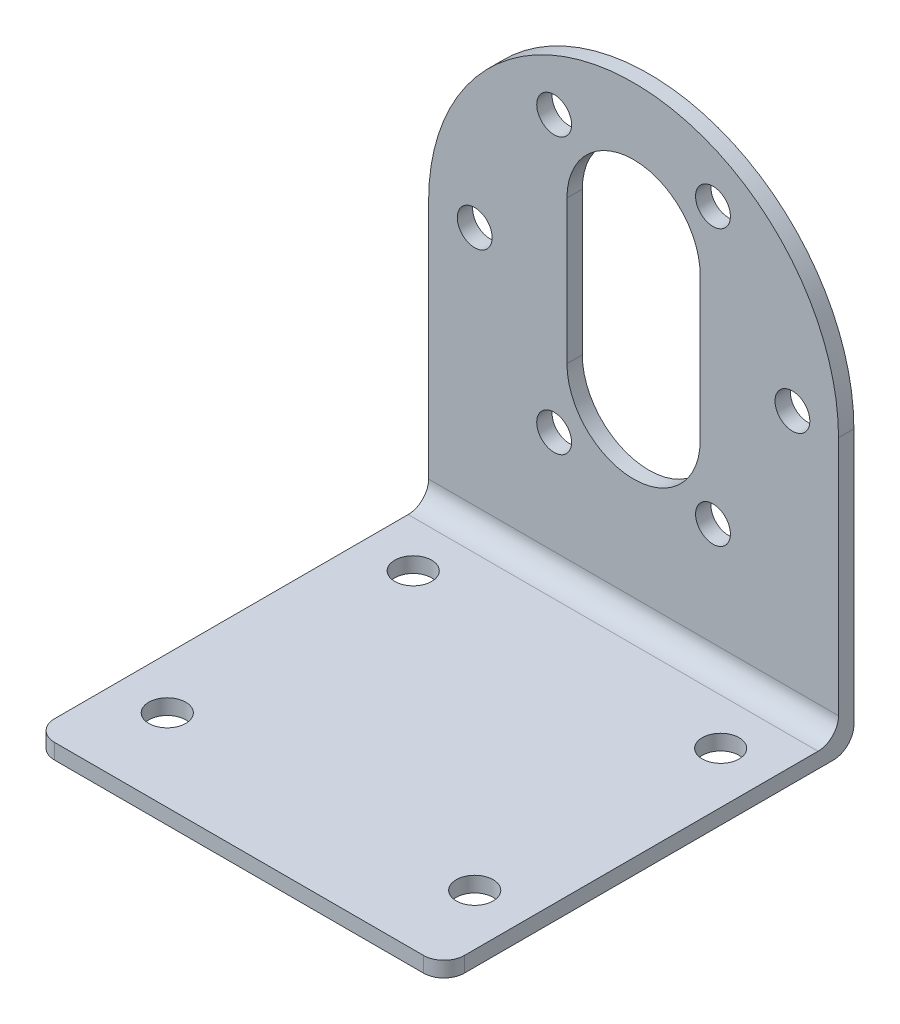
ISO-10303-21;
HEADER;
FILE_DESCRIPTION(('STEP AP214'),'2;1');
FILE_NAME('part.step','',(''),(''),'','','');
FILE_SCHEMA(('AUTOMOTIVE_DESIGN { 1 0 10303 214 1 1 1 1 }'));
ENDSEC;
DATA;
#1=APPLICATION_CONTEXT('core data for automotive mechanical design processes');
#2=APPLICATION_PROTOCOL_DEFINITION('international standard','automotive_design',2000,#1);
#3=PRODUCT_CONTEXT('',#1,'mechanical');
#4=PRODUCT('Part','Part','',(#3));
#5=PRODUCT_RELATED_PRODUCT_CATEGORY('part','',(#4));
#6=PRODUCT_DEFINITION_FORMATION('','',#4);
#7=PRODUCT_DEFINITION_CONTEXT('part definition',#1,'design');
#8=PRODUCT_DEFINITION('design','',#6,#7);
#9=PRODUCT_DEFINITION_SHAPE('','',#8);
#10=(LENGTH_UNIT() NAMED_UNIT(*) SI_UNIT(.MILLI.,.METRE.));
#11=(NAMED_UNIT(*) PLANE_ANGLE_UNIT() SI_UNIT($,.RADIAN.));
#12=(NAMED_UNIT(*) SI_UNIT($,.STERADIAN.) SOLID_ANGLE_UNIT());
#13=UNCERTAINTY_MEASURE_WITH_UNIT(LENGTH_MEASURE(1.E-05),#10,'distance_accuracy_value','');
#14=(GEOMETRIC_REPRESENTATION_CONTEXT(3) GLOBAL_UNCERTAINTY_ASSIGNED_CONTEXT((#13)) GLOBAL_UNIT_ASSIGNED_CONTEXT((#10,
#11,#12)) REPRESENTATION_CONTEXT('',''));
#15=CARTESIAN_POINT('',(0.,0.,0.));
#16=DIRECTION('',(0.,0.,1.));
#17=DIRECTION('',(1.,0.,0.));
#18=AXIS2_PLACEMENT_3D('',#15,#16,#17);
#19=CARTESIAN_POINT('',(0.,1.5,-40.));
#20=DIRECTION('',(0.,0.,1.));
#21=DIRECTION('',(1.,0.,0.));
#22=AXIS2_PLACEMENT_3D('',#19,#20,#21);
#23=PLANE('',#22);
#24=CARTESIAN_POINT('',(35.5,27.,-40.));
#25=DIRECTION('',(0.,0.,-1.));
#26=DIRECTION('',(-1.,0.,0.));
#27=AXIS2_PLACEMENT_3D('',#24,#25,#26);
#28=CIRCLE('',#27,1.7);
#29=CARTESIAN_POINT('',(33.8,27.,-40.));
#30=VERTEX_POINT('',#29);
#31=EDGE_CURVE('E403',#30,#30,#28,.T.);
#32=ORIENTED_EDGE('',*,*,#31,.F.);
#33=EDGE_LOOP('',(#32));
#34=FACE_BOUND('',#33,.T.);
#35=CARTESIAN_POINT('',(27.7500000000002,13.5766062413413,-40.));
#36=DIRECTION('',(0.,0.,-1.));
#37=DIRECTION('',(-1.,0.,0.));
#38=AXIS2_PLACEMENT_3D('',#35,#36,#37);
#39=CIRCLE('',#38,1.7);
#40=CARTESIAN_POINT('',(26.0500000000002,13.5766062413413,-40.));
#41=VERTEX_POINT('',#40);
#42=EDGE_CURVE('E411',#41,#41,#39,.T.);
#43=ORIENTED_EDGE('',*,*,#42,.F.);
#44=EDGE_LOOP('',(#43));
#45=FACE_BOUND('',#44,.T.);
#46=CARTESIAN_POINT('',(12.2500000000001,13.5766062413411,-40.));
#47=DIRECTION('',(0.,0.,-1.));
#48=DIRECTION('',(-1.,0.,0.));
#49=AXIS2_PLACEMENT_3D('',#46,#47,#48);
#50=CIRCLE('',#49,1.7);
#51=CARTESIAN_POINT('',(10.5500000000001,13.5766062413411,-40.));
#52=VERTEX_POINT('',#51);
#53=EDGE_CURVE('E430',#52,#52,#50,.T.);
#54=ORIENTED_EDGE('',*,*,#53,.F.);
#55=EDGE_LOOP('',(#54));
#56=FACE_BOUND('',#55,.T.);
#57=CARTESIAN_POINT('',(4.5,26.9999999999999,-40.));
#58=DIRECTION('',(0.,0.,-1.));
#59=DIRECTION('',(-1.,0.,0.));
#60=AXIS2_PLACEMENT_3D('',#57,#58,#59);
#61=CIRCLE('',#60,1.7);
#62=CARTESIAN_POINT('',(2.8,26.9999999999999,-40.));
#63=VERTEX_POINT('',#62);
#64=EDGE_CURVE('E424',#63,#63,#61,.T.);
#65=ORIENTED_EDGE('',*,*,#64,.F.);
#66=EDGE_LOOP('',(#65));
#67=FACE_BOUND('',#66,.T.);
#68=CARTESIAN_POINT('',(12.2499999999999,40.4233937586588,-40.));
#69=DIRECTION('',(0.,0.,-1.));
#70=DIRECTION('',(-1.,0.,0.));
#71=AXIS2_PLACEMENT_3D('',#68,#69,#70);
#72=CIRCLE('',#71,1.7);
#73=CARTESIAN_POINT('',(10.5499999999999,40.4233937586588,-40.));
#74=VERTEX_POINT('',#73);
#75=EDGE_CURVE('E418',#74,#74,#72,.T.);
#76=ORIENTED_EDGE('',*,*,#75,.F.);
#77=EDGE_LOOP('',(#76));
#78=FACE_BOUND('',#77,.T.);
#79=CARTESIAN_POINT('',(27.75,40.4233937586588,-40.));
#80=DIRECTION('',(0.,0.,-1.));
#81=DIRECTION('',(-1.,0.,0.));
#82=AXIS2_PLACEMENT_3D('',#79,#80,#81);
#83=CIRCLE('',#82,1.7);
#84=CARTESIAN_POINT('',(26.05,40.4233937586588,-40.));
#85=VERTEX_POINT('',#84);
#86=EDGE_CURVE('E406',#85,#85,#83,.T.);
#87=ORIENTED_EDGE('',*,*,#86,.F.);
#88=EDGE_LOOP('',(#87));
#89=FACE_BOUND('',#88,.T.);
#90=CARTESIAN_POINT('',(20.,20.,-40.));
#91=DIRECTION('',(0.,0.,-1.));
#92=DIRECTION('',(-1.,0.,0.));
#93=AXIS2_PLACEMENT_3D('',#90,#91,#92);
#94=CIRCLE('',#93,6.5);
#95=CARTESIAN_POINT('',(26.5,20.,-40.));
#96=VERTEX_POINT('',#95);
#97=CARTESIAN_POINT('',(13.5,20.,-40.));
#98=VERTEX_POINT('',#97);
#99=EDGE_CURVE('E447',#96,#98,#94,.T.);
#100=ORIENTED_EDGE('',*,*,#99,.F.);
#101=DIRECTION('',(0.,-1.,0.));
#102=VECTOR('',#101,1.);
#103=CARTESIAN_POINT('',(26.5,0.,-40.));
#104=LINE('',#103,#102);
#105=CARTESIAN_POINT('',(26.5,34.,-40.));
#106=VERTEX_POINT('',#105);
#107=EDGE_CURVE('E445',#106,#96,#104,.T.);
#108=ORIENTED_EDGE('',*,*,#107,.F.);
#109=CARTESIAN_POINT('',(20.,34.,-40.));
#110=DIRECTION('',(0.,0.,-1.));
#111=DIRECTION('',(-1.,0.,0.));
#112=AXIS2_PLACEMENT_3D('',#109,#110,#111);
#113=CIRCLE('',#112,6.5);
#114=CARTESIAN_POINT('',(13.5,34.,-40.));
#115=VERTEX_POINT('',#114);
#116=EDGE_CURVE('E453',#115,#106,#113,.T.);
#117=ORIENTED_EDGE('',*,*,#116,.F.);
#118=DIRECTION('',(0.,-1.,0.));
#119=VECTOR('',#118,1.);
#120=CARTESIAN_POINT('',(13.5,0.,-40.));
#121=LINE('',#120,#119);
#122=EDGE_CURVE('E450',#115,#98,#121,.T.);
#123=ORIENTED_EDGE('',*,*,#122,.T.);
#124=EDGE_LOOP('',(#100,#108,#117,#123));
#125=FACE_BOUND('',#124,.T.);
#126=DIRECTION('',(0.,-1.,0.));
#127=VECTOR('',#126,1.);
#128=CARTESIAN_POINT('',(40.,1.5,-40.));
#129=LINE('',#128,#127);
#130=CARTESIAN_POINT('',(40.,27.,-40.));
#131=VERTEX_POINT('',#130);
#132=CARTESIAN_POINT('',(40.,2.,-40.));
#133=VERTEX_POINT('',#132);
#134=EDGE_CURVE('E235',#131,#133,#129,.T.);
#135=ORIENTED_EDGE('',*,*,#134,.T.);
#136=DIRECTION('',(-1.,0.,0.));
#137=VECTOR('',#136,1.);
#138=CARTESIAN_POINT('',(0.,2.,-40.));
#139=LINE('',#138,#137);
#140=CARTESIAN_POINT('',(0.,2.,-40.));
#141=VERTEX_POINT('',#140);
#142=EDGE_CURVE('E246',#133,#141,#139,.T.);
#143=ORIENTED_EDGE('',*,*,#142,.T.);
#144=DIRECTION('',(0.,-1.,0.));
#145=VECTOR('',#144,1.);
#146=CARTESIAN_POINT('',(0.,1.5,-40.));
#147=LINE('',#146,#145);
#148=CARTESIAN_POINT('',(0.,27.,-40.));
#149=VERTEX_POINT('',#148);
#150=EDGE_CURVE('E229',#149,#141,#147,.T.);
#151=ORIENTED_EDGE('',*,*,#150,.F.);
#152=CARTESIAN_POINT('',(20.,27.,-40.));
#153=DIRECTION('',(0.,0.,-1.));
#154=DIRECTION('',(-1.,0.,0.));
#155=AXIS2_PLACEMENT_3D('',#152,#153,#154);
#156=CIRCLE('',#155,20.);
#157=EDGE_CURVE('E195',#149,#131,#156,.T.);
#158=ORIENTED_EDGE('',*,*,#157,.T.);
#159=EDGE_LOOP('',(#135,#143,#151,#158));
#160=FACE_BOUND('',#159,.T.);
#161=ADVANCED_FACE('F82',(#34,#45,#56,#67,#78,#89,#125,#160),#23,.F.);
#162=CARTESIAN_POINT('',(0.,47.,-38.5));
#163=DIRECTION('',(0.,0.,-1.));
#164=DIRECTION('',(-1.,0.,0.));
#165=AXIS2_PLACEMENT_3D('',#162,#163,#164);
#166=PLANE('',#165);
#167=CARTESIAN_POINT('',(35.5,27.,-38.5));
#168=DIRECTION('',(0.,0.,-1.));
#169=DIRECTION('',(-1.,0.,0.));
#170=AXIS2_PLACEMENT_3D('',#167,#168,#169);
#171=CIRCLE('',#170,1.7);
#172=CARTESIAN_POINT('',(33.8,27.,-38.5));
#173=VERTEX_POINT('',#172);
#174=EDGE_CURVE('E206',#173,#173,#171,.F.);
#175=ORIENTED_EDGE('',*,*,#174,.F.);
#176=EDGE_LOOP('',(#175));
#177=FACE_BOUND('',#176,.T.);
#178=CARTESIAN_POINT('',(27.7500000000002,13.5766062413413,-38.5));
#179=DIRECTION('',(0.,0.,-1.));
#180=DIRECTION('',(-1.,0.,0.));
#181=AXIS2_PLACEMENT_3D('',#178,#179,#180);
#182=CIRCLE('',#181,1.7);
#183=CARTESIAN_POINT('',(26.0500000000002,13.5766062413413,-38.5));
#184=VERTEX_POINT('',#183);
#185=EDGE_CURVE('E400',#184,#184,#182,.F.);
#186=ORIENTED_EDGE('',*,*,#185,.F.);
#187=EDGE_LOOP('',(#186));
#188=FACE_BOUND('',#187,.T.);
#189=CARTESIAN_POINT('',(12.2500000000001,13.5766062413411,-38.5));
#190=DIRECTION('',(0.,0.,-1.));
#191=DIRECTION('',(-1.,0.,0.));
#192=AXIS2_PLACEMENT_3D('',#189,#190,#191);
#193=CIRCLE('',#192,1.7);
#194=CARTESIAN_POINT('',(10.5500000000001,13.5766062413411,-38.5));
#195=VERTEX_POINT('',#194);
#196=EDGE_CURVE('E414',#195,#195,#193,.F.);
#197=ORIENTED_EDGE('',*,*,#196,.F.);
#198=EDGE_LOOP('',(#197));
#199=FACE_BOUND('',#198,.T.);
#200=CARTESIAN_POINT('',(4.5,26.9999999999999,-38.5));
#201=DIRECTION('',(0.,0.,-1.));
#202=DIRECTION('',(-1.,0.,0.));
#203=AXIS2_PLACEMENT_3D('',#200,#201,#202);
#204=CIRCLE('',#203,1.7);
#205=CARTESIAN_POINT('',(2.8,26.9999999999999,-38.5));
#206=VERTEX_POINT('',#205);
#207=EDGE_CURVE('E427',#206,#206,#204,.F.);
#208=ORIENTED_EDGE('',*,*,#207,.F.);
#209=EDGE_LOOP('',(#208));
#210=FACE_BOUND('',#209,.T.);
#211=CARTESIAN_POINT('',(12.2499999999999,40.4233937586588,-38.5));
#212=DIRECTION('',(0.,0.,-1.));
#213=DIRECTION('',(-1.,0.,0.));
#214=AXIS2_PLACEMENT_3D('',#211,#212,#213);
#215=CIRCLE('',#214,1.7);
#216=CARTESIAN_POINT('',(10.5499999999999,40.4233937586588,-38.5));
#217=VERTEX_POINT('',#216);
#218=EDGE_CURVE('E421',#217,#217,#215,.F.);
#219=ORIENTED_EDGE('',*,*,#218,.F.);
#220=EDGE_LOOP('',(#219));
#221=FACE_BOUND('',#220,.T.);
#222=CARTESIAN_POINT('',(27.75,40.4233937586588,-38.5));
#223=DIRECTION('',(0.,0.,-1.));
#224=DIRECTION('',(-1.,0.,0.));
#225=AXIS2_PLACEMENT_3D('',#222,#223,#224);
#226=CIRCLE('',#225,1.7);
#227=CARTESIAN_POINT('',(26.05,40.4233937586588,-38.5));
#228=VERTEX_POINT('',#227);
#229=EDGE_CURVE('E415',#228,#228,#226,.F.);
#230=ORIENTED_EDGE('',*,*,#229,.F.);
#231=EDGE_LOOP('',(#230));
#232=FACE_BOUND('',#231,.T.);
#233=CARTESIAN_POINT('',(20.,34.,-38.5));
#234=DIRECTION('',(0.,0.,-1.));
#235=DIRECTION('',(-1.,0.,0.));
#236=AXIS2_PLACEMENT_3D('',#233,#234,#235);
#237=CIRCLE('',#236,6.5);
#238=CARTESIAN_POINT('',(26.5,34.,-38.5));
#239=VERTEX_POINT('',#238);
#240=CARTESIAN_POINT('',(13.5,34.,-38.5));
#241=VERTEX_POINT('',#240);
#242=EDGE_CURVE('E439',#239,#241,#237,.F.);
#243=ORIENTED_EDGE('',*,*,#242,.F.);
#244=DIRECTION('',(0.,1.,0.));
#245=VECTOR('',#244,1.);
#246=CARTESIAN_POINT('',(26.5,0.,-38.5));
#247=LINE('',#246,#245);
#248=CARTESIAN_POINT('',(26.5,20.,-38.5));
#249=VERTEX_POINT('',#248);
#250=EDGE_CURVE('E442',#249,#239,#247,.T.);
#251=ORIENTED_EDGE('',*,*,#250,.F.);
#252=CARTESIAN_POINT('',(20.,20.,-38.5));
#253=DIRECTION('',(0.,0.,-1.));
#254=DIRECTION('',(-1.,0.,0.));
#255=AXIS2_PLACEMENT_3D('',#252,#253,#254);
#256=CIRCLE('',#255,6.5);
#257=CARTESIAN_POINT('',(13.5,20.,-38.5));
#258=VERTEX_POINT('',#257);
#259=EDGE_CURVE('E196',#258,#249,#256,.F.);
#260=ORIENTED_EDGE('',*,*,#259,.F.);
#261=DIRECTION('',(0.,1.,0.));
#262=VECTOR('',#261,1.);
#263=CARTESIAN_POINT('',(13.5,0.,-38.5));
#264=LINE('',#263,#262);
#265=EDGE_CURVE('E205',#258,#241,#264,.T.);
#266=ORIENTED_EDGE('',*,*,#265,.T.);
#267=EDGE_LOOP('',(#243,#251,#260,#266));
#268=FACE_BOUND('',#267,.T.);
#269=DIRECTION('',(0.,-1.,0.));
#270=VECTOR('',#269,1.);
#271=CARTESIAN_POINT('',(0.,47.,-38.5));
#272=LINE('',#271,#270);
#273=CARTESIAN_POINT('',(0.,27.,-38.5));
#274=VERTEX_POINT('',#273);
#275=CARTESIAN_POINT('',(0.,3.5,-38.5));
#276=VERTEX_POINT('',#275);
#277=EDGE_CURVE('E189',#274,#276,#272,.T.);
#278=ORIENTED_EDGE('',*,*,#277,.T.);
#279=DIRECTION('',(1.,0.,0.));
#280=VECTOR('',#279,1.);
#281=CARTESIAN_POINT('',(40.,3.5,-38.5));
#282=LINE('',#281,#280);
#283=CARTESIAN_POINT('',(40.,3.5,-38.5));
#284=VERTEX_POINT('',#283);
#285=EDGE_CURVE('E238',#276,#284,#282,.T.);
#286=ORIENTED_EDGE('',*,*,#285,.T.);
#287=DIRECTION('',(0.,-1.,0.));
#288=VECTOR('',#287,1.);
#289=CARTESIAN_POINT('',(40.,47.,-38.5));
#290=LINE('',#289,#288);
#291=CARTESIAN_POINT('',(40.,27.,-38.5));
#292=VERTEX_POINT('',#291);
#293=EDGE_CURVE('E192',#292,#284,#290,.T.);
#294=ORIENTED_EDGE('',*,*,#293,.F.);
#295=CARTESIAN_POINT('',(20.,27.,-38.5));
#296=DIRECTION('',(0.,0.,-1.));
#297=DIRECTION('',(-1.,0.,0.));
#298=AXIS2_PLACEMENT_3D('',#295,#296,#297);
#299=CIRCLE('',#298,20.);
#300=EDGE_CURVE('E184',#292,#274,#299,.F.);
#301=ORIENTED_EDGE('',*,*,#300,.T.);
#302=EDGE_LOOP('',(#278,#286,#294,#301));
#303=FACE_BOUND('',#302,.T.);
#304=ADVANCED_FACE('F186',(#177,#188,#199,#210,#221,#232,#268,#303),#166,.F.);
#305=CARTESIAN_POINT('',(40.,1.5,0.));
#306=DIRECTION('',(-1.,0.,0.));
#307=DIRECTION('',(0.,0.,1.));
#308=AXIS2_PLACEMENT_3D('',#305,#306,#307);
#309=PLANE('',#308);
#310=DIRECTION('',(0.,0.,-1.));
#311=VECTOR('',#310,1.);
#312=CARTESIAN_POINT('',(40.,0.,0.));
#313=LINE('',#312,#311);
#314=CARTESIAN_POINT('',(40.,0.,-2.));
#315=VERTEX_POINT('',#314);
#316=CARTESIAN_POINT('',(40.,0.,-38.));
#317=VERTEX_POINT('',#316);
#318=EDGE_CURVE('E224',#315,#317,#313,.T.);
#319=ORIENTED_EDGE('',*,*,#318,.T.);
#320=CARTESIAN_POINT('',(40.,2.,-38.));
#321=DIRECTION('',(-1.,0.,0.));
#322=DIRECTION('',(0.,0.,1.));
#323=AXIS2_PLACEMENT_3D('',#320,#321,#322);
#324=CIRCLE('',#323,2.);
#325=EDGE_CURVE('E260',#317,#133,#324,.F.);
#326=ORIENTED_EDGE('',*,*,#325,.T.);
#327=ORIENTED_EDGE('',*,*,#134,.F.);
#328=DIRECTION('',(0.,0.,-1.));
#329=VECTOR('',#328,1.);
#330=CARTESIAN_POINT('',(40.,27.,0.001000000000001));
#331=LINE('',#330,#329);
#332=EDGE_CURVE('E216',#292,#131,#331,.T.);
#333=ORIENTED_EDGE('',*,*,#332,.F.);
#334=ORIENTED_EDGE('',*,*,#293,.T.);
#335=CARTESIAN_POINT('',(40.,3.5,-36.5));
#336=DIRECTION('',(-1.,0.,0.));
#337=DIRECTION('',(0.,0.,1.));
#338=AXIS2_PLACEMENT_3D('',#335,#336,#337);
#339=CIRCLE('',#338,2.);
#340=CARTESIAN_POINT('',(40.,1.5,-36.5));
#341=VERTEX_POINT('',#340);
#342=EDGE_CURVE('E90',#284,#341,#339,.T.);
#343=ORIENTED_EDGE('',*,*,#342,.T.);
#344=DIRECTION('',(0.,0.,-1.));
#345=VECTOR('',#344,1.);
#346=CARTESIAN_POINT('',(40.,1.5,0.));
#347=LINE('',#346,#345);
#348=CARTESIAN_POINT('',(40.,1.5,-2.));
#349=VERTEX_POINT('',#348);
#350=EDGE_CURVE('E227',#349,#341,#347,.T.);
#351=ORIENTED_EDGE('',*,*,#350,.F.);
#352=DIRECTION('',(0.,-1.,0.));
#353=VECTOR('',#352,1.);
#354=CARTESIAN_POINT('',(40.,1.5,-2.));
#355=LINE('',#354,#353);
#356=EDGE_CURVE('E257',#349,#315,#355,.T.);
#357=ORIENTED_EDGE('',*,*,#356,.T.);
#358=EDGE_LOOP('',(#319,#326,#327,#333,#334,#343,#351,#357));
#359=FACE_BOUND('',#358,.T.);
#360=ADVANCED_FACE('F267',(#359),#309,.F.);
#361=CARTESIAN_POINT('',(0.,1.5,0.));
#362=DIRECTION('',(0.,-1.,0.));
#363=DIRECTION('',(0.,0.,-1.));
#364=AXIS2_PLACEMENT_3D('',#361,#362,#363);
#365=PLANE('',#364);
#366=CARTESIAN_POINT('',(35.,1.5,-8.));
#367=DIRECTION('',(0.,1.,0.));
#368=DIRECTION('',(0.,0.,1.));
#369=AXIS2_PLACEMENT_3D('',#366,#367,#368);
#370=CIRCLE('',#369,1.8);
#371=CARTESIAN_POINT('',(35.,1.5,-6.2));
#372=VERTEX_POINT('',#371);
#373=EDGE_CURVE('E389',#372,#372,#370,.T.);
#374=ORIENTED_EDGE('',*,*,#373,.F.);
#375=EDGE_LOOP('',(#374));
#376=FACE_BOUND('',#375,.T.);
#377=CARTESIAN_POINT('',(5.,1.5,-32.));
#378=DIRECTION('',(0.,1.,0.));
#379=DIRECTION('',(0.,0.,1.));
#380=AXIS2_PLACEMENT_3D('',#377,#378,#379);
#381=CIRCLE('',#380,1.8);
#382=CARTESIAN_POINT('',(5.,1.5,-30.2));
#383=VERTEX_POINT('',#382);
#384=EDGE_CURVE('E382',#383,#383,#381,.T.);
#385=ORIENTED_EDGE('',*,*,#384,.F.);
#386=EDGE_LOOP('',(#385));
#387=FACE_BOUND('',#386,.T.);
#388=CARTESIAN_POINT('',(5.,1.5,-8.));
#389=DIRECTION('',(0.,1.,0.));
#390=DIRECTION('',(0.,0.,1.));
#391=AXIS2_PLACEMENT_3D('',#388,#389,#390);
#392=CIRCLE('',#391,1.8);
#393=CARTESIAN_POINT('',(5.,1.5,-6.2));
#394=VERTEX_POINT('',#393);
#395=EDGE_CURVE('E379',#394,#394,#392,.T.);
#396=ORIENTED_EDGE('',*,*,#395,.F.);
#397=EDGE_LOOP('',(#396));
#398=FACE_BOUND('',#397,.T.);
#399=CARTESIAN_POINT('',(35.,1.5,-32.));
#400=DIRECTION('',(0.,1.,0.));
#401=DIRECTION('',(0.,0.,1.));
#402=AXIS2_PLACEMENT_3D('',#399,#400,#401);
#403=CIRCLE('',#402,1.8);
#404=CARTESIAN_POINT('',(35.,1.5,-30.2));
#405=VERTEX_POINT('',#404);
#406=EDGE_CURVE('E397',#405,#405,#403,.T.);
#407=ORIENTED_EDGE('',*,*,#406,.F.);
#408=EDGE_LOOP('',(#407));
#409=FACE_BOUND('',#408,.T.);
#410=ORIENTED_EDGE('',*,*,#350,.T.);
#411=DIRECTION('',(1.,0.,0.));
#412=VECTOR('',#411,1.);
#413=CARTESIAN_POINT('',(0.,1.5,-36.5));
#414=LINE('',#413,#412);
#415=CARTESIAN_POINT('',(0.,1.5,-36.5));
#416=VERTEX_POINT('',#415);
#417=EDGE_CURVE('E244',#341,#416,#414,.F.);
#418=ORIENTED_EDGE('',*,*,#417,.T.);
#419=DIRECTION('',(0.,0.,1.));
#420=VECTOR('',#419,1.);
#421=CARTESIAN_POINT('',(0.,1.5,0.));
#422=LINE('',#421,#420);
#423=CARTESIAN_POINT('',(0.,1.5,-2.));
#424=VERTEX_POINT('',#423);
#425=EDGE_CURVE('E220',#416,#424,#422,.T.);
#426=ORIENTED_EDGE('',*,*,#425,.T.);
#427=CARTESIAN_POINT('',(2.,1.5,-2.));
#428=DIRECTION('',(0.,-1.,0.));
#429=DIRECTION('',(0.,0.,-1.));
#430=AXIS2_PLACEMENT_3D('',#427,#428,#429);
#431=CIRCLE('',#430,2.);
#432=CARTESIAN_POINT('',(2.,1.5,0.));
#433=VERTEX_POINT('',#432);
#434=EDGE_CURVE('E240',#424,#433,#431,.F.);
#435=ORIENTED_EDGE('',*,*,#434,.T.);
#436=DIRECTION('',(1.,0.,0.));
#437=VECTOR('',#436,1.);
#438=CARTESIAN_POINT('',(0.,1.5,0.));
#439=LINE('',#438,#437);
#440=CARTESIAN_POINT('',(38.,1.5,0.));
#441=VERTEX_POINT('',#440);
#442=EDGE_CURVE('E223',#433,#441,#439,.T.);
#443=ORIENTED_EDGE('',*,*,#442,.T.);
#444=CARTESIAN_POINT('',(38.,1.5,-2.));
#445=DIRECTION('',(0.,-1.,0.));
#446=DIRECTION('',(0.,0.,-1.));
#447=AXIS2_PLACEMENT_3D('',#444,#445,#446);
#448=CIRCLE('',#447,2.);
#449=EDGE_CURVE('E242',#441,#349,#448,.F.);
#450=ORIENTED_EDGE('',*,*,#449,.T.);
#451=EDGE_LOOP('',(#410,#418,#426,#435,#443,#450));
#452=FACE_BOUND('',#451,.T.);
#453=ADVANCED_FACE('F272',(#376,#387,#398,#409,#452),#365,.F.);
#454=CARTESIAN_POINT('',(0.,1.5,0.));
#455=DIRECTION('',(1.,0.,0.));
#456=DIRECTION('',(0.,0.,-1.));
#457=AXIS2_PLACEMENT_3D('',#454,#455,#456);
#458=PLANE('',#457);
#459=ORIENTED_EDGE('',*,*,#150,.T.);
#460=CARTESIAN_POINT('',(0.,2.,-38.));
#461=DIRECTION('',(1.,0.,0.));
#462=DIRECTION('',(0.,0.,-1.));
#463=AXIS2_PLACEMENT_3D('',#460,#461,#462);
#464=CIRCLE('',#463,2.);
#465=CARTESIAN_POINT('',(0.,0.,-38.));
#466=VERTEX_POINT('',#465);
#467=EDGE_CURVE('E251',#141,#466,#464,.F.);
#468=ORIENTED_EDGE('',*,*,#467,.T.);
#469=DIRECTION('',(0.,0.,1.));
#470=VECTOR('',#469,1.);
#471=CARTESIAN_POINT('',(0.,0.,0.));
#472=LINE('',#471,#470);
#473=CARTESIAN_POINT('',(0.,0.,-2.));
#474=VERTEX_POINT('',#473);
#475=EDGE_CURVE('E211',#466,#474,#472,.T.);
#476=ORIENTED_EDGE('',*,*,#475,.T.);
#477=DIRECTION('',(0.,-1.,0.));
#478=VECTOR('',#477,1.);
#479=CARTESIAN_POINT('',(0.,1.5,-2.));
#480=LINE('',#479,#478);
#481=EDGE_CURVE('E249',#474,#424,#480,.F.);
#482=ORIENTED_EDGE('',*,*,#481,.T.);
#483=ORIENTED_EDGE('',*,*,#425,.F.);
#484=CARTESIAN_POINT('',(0.,3.5,-36.5));
#485=DIRECTION('',(1.,0.,0.));
#486=DIRECTION('',(0.,0.,-1.));
#487=AXIS2_PLACEMENT_3D('',#484,#485,#486);
#488=CIRCLE('',#487,2.);
#489=EDGE_CURVE('E12',#416,#276,#488,.T.);
#490=ORIENTED_EDGE('',*,*,#489,.T.);
#491=ORIENTED_EDGE('',*,*,#277,.F.);
#492=DIRECTION('',(0.,0.,-1.));
#493=VECTOR('',#492,1.);
#494=CARTESIAN_POINT('',(0.,27.,0.001000000000001));
#495=LINE('',#494,#493);
#496=EDGE_CURVE('E199',#274,#149,#495,.T.);
#497=ORIENTED_EDGE('',*,*,#496,.T.);
#498=EDGE_LOOP('',(#459,#468,#476,#482,#483,#490,#491,#497));
#499=FACE_BOUND('',#498,.T.);
#500=ADVANCED_FACE('F208',(#499),#458,.F.);
#501=CARTESIAN_POINT('',(0.,1.5,0.));
#502=DIRECTION('',(0.,0.,-1.));
#503=DIRECTION('',(-1.,0.,0.));
#504=AXIS2_PLACEMENT_3D('',#501,#502,#503);
#505=PLANE('',#504);
#506=DIRECTION('',(1.,0.,0.));
#507=VECTOR('',#506,1.);
#508=CARTESIAN_POINT('',(0.,0.,0.));
#509=LINE('',#508,#507);
#510=CARTESIAN_POINT('',(2.,0.,0.));
#511=VERTEX_POINT('',#510);
#512=CARTESIAN_POINT('',(38.,0.,0.));
#513=VERTEX_POINT('',#512);
#514=EDGE_CURVE('E214',#511,#513,#509,.T.);
#515=ORIENTED_EDGE('',*,*,#514,.T.);
#516=DIRECTION('',(0.,-1.,0.));
#517=VECTOR('',#516,1.);
#518=CARTESIAN_POINT('',(38.,1.5,0.));
#519=LINE('',#518,#517);
#520=EDGE_CURVE('E264',#513,#441,#519,.F.);
#521=ORIENTED_EDGE('',*,*,#520,.T.);
#522=ORIENTED_EDGE('',*,*,#442,.F.);
#523=DIRECTION('',(0.,-1.,0.));
#524=VECTOR('',#523,1.);
#525=CARTESIAN_POINT('',(2.,1.5,0.));
#526=LINE('',#525,#524);
#527=EDGE_CURVE('E262',#433,#511,#526,.T.);
#528=ORIENTED_EDGE('',*,*,#527,.T.);
#529=EDGE_LOOP('',(#515,#521,#522,#528));
#530=FACE_BOUND('',#529,.T.);
#531=ADVANCED_FACE('F306',(#530),#505,.F.);
#532=CARTESIAN_POINT('',(0.,0.,0.));
#533=DIRECTION('',(0.,-1.,0.));
#534=DIRECTION('',(0.,0.,-1.));
#535=AXIS2_PLACEMENT_3D('',#532,#533,#534);
#536=PLANE('',#535);
#537=CARTESIAN_POINT('',(35.,0.,-8.));
#538=DIRECTION('',(0.,-1.,0.));
#539=DIRECTION('',(0.,0.,-1.));
#540=AXIS2_PLACEMENT_3D('',#537,#538,#539);
#541=CIRCLE('',#540,1.8);
#542=CARTESIAN_POINT('',(35.,0.,-9.8));
#543=VERTEX_POINT('',#542);
#544=EDGE_CURVE('E385',#543,#543,#541,.F.);
#545=ORIENTED_EDGE('',*,*,#544,.T.);
#546=EDGE_LOOP('',(#545));
#547=FACE_BOUND('',#546,.T.);
#548=CARTESIAN_POINT('',(5.,0.,-32.));
#549=DIRECTION('',(0.,-1.,0.));
#550=DIRECTION('',(0.,0.,-1.));
#551=AXIS2_PLACEMENT_3D('',#548,#549,#550);
#552=CIRCLE('',#551,1.8);
#553=CARTESIAN_POINT('',(5.,0.,-33.8));
#554=VERTEX_POINT('',#553);
#555=EDGE_CURVE('E392',#554,#554,#552,.F.);
#556=ORIENTED_EDGE('',*,*,#555,.T.);
#557=EDGE_LOOP('',(#556));
#558=FACE_BOUND('',#557,.T.);
#559=CARTESIAN_POINT('',(5.,0.,-8.));
#560=DIRECTION('',(0.,-1.,0.));
#561=DIRECTION('',(0.,0.,-1.));
#562=AXIS2_PLACEMENT_3D('',#559,#560,#561);
#563=CIRCLE('',#562,1.8);
#564=CARTESIAN_POINT('',(5.,0.,-9.8));
#565=VERTEX_POINT('',#564);
#566=EDGE_CURVE('E376',#565,#565,#563,.F.);
#567=ORIENTED_EDGE('',*,*,#566,.T.);
#568=EDGE_LOOP('',(#567));
#569=FACE_BOUND('',#568,.T.);
#570=CARTESIAN_POINT('',(35.,0.,-32.));
#571=DIRECTION('',(0.,-1.,0.));
#572=DIRECTION('',(0.,0.,-1.));
#573=AXIS2_PLACEMENT_3D('',#570,#571,#572);
#574=CIRCLE('',#573,1.8);
#575=CARTESIAN_POINT('',(35.,0.,-33.8));
#576=VERTEX_POINT('',#575);
#577=EDGE_CURVE('E388',#576,#576,#574,.F.);
#578=ORIENTED_EDGE('',*,*,#577,.T.);
#579=EDGE_LOOP('',(#578));
#580=FACE_BOUND('',#579,.T.);
#581=ORIENTED_EDGE('',*,*,#475,.F.);
#582=DIRECTION('',(-1.,0.,0.));
#583=VECTOR('',#582,1.);
#584=CARTESIAN_POINT('',(40.,0.,-38.));
#585=LINE('',#584,#583);
#586=EDGE_CURVE('E255',#466,#317,#585,.F.);
#587=ORIENTED_EDGE('',*,*,#586,.T.);
#588=ORIENTED_EDGE('',*,*,#318,.F.);
#589=CARTESIAN_POINT('',(38.,0.,-2.));
#590=DIRECTION('',(0.,-1.,0.));
#591=DIRECTION('',(0.,0.,-1.));
#592=AXIS2_PLACEMENT_3D('',#589,#590,#591);
#593=CIRCLE('',#592,2.);
#594=EDGE_CURVE('E97',#315,#513,#593,.T.);
#595=ORIENTED_EDGE('',*,*,#594,.T.);
#596=ORIENTED_EDGE('',*,*,#514,.F.);
#597=CARTESIAN_POINT('',(2.,0.,-2.));
#598=DIRECTION('',(0.,-1.,0.));
#599=DIRECTION('',(0.,0.,-1.));
#600=AXIS2_PLACEMENT_3D('',#597,#598,#599);
#601=CIRCLE('',#600,2.);
#602=EDGE_CURVE('E105',#511,#474,#601,.T.);
#603=ORIENTED_EDGE('',*,*,#602,.T.);
#604=EDGE_LOOP('',(#581,#587,#588,#595,#596,#603));
#605=FACE_BOUND('',#604,.T.);
#606=ADVANCED_FACE('F302',(#547,#558,#569,#580,#605),#536,.T.);
#607=CARTESIAN_POINT('',(20.,27.,0.001000000000001));
#608=DIRECTION('',(0.,0.,-1.));
#609=DIRECTION('',(-1.,0.,0.));
#610=AXIS2_PLACEMENT_3D('',#607,#608,#609);
#611=CYLINDRICAL_SURFACE('',#610,20.);
#612=ORIENTED_EDGE('',*,*,#332,.T.);
#613=ORIENTED_EDGE('',*,*,#157,.F.);
#614=ORIENTED_EDGE('',*,*,#496,.F.);
#615=ORIENTED_EDGE('',*,*,#300,.F.);
#616=EDGE_LOOP('',(#612,#613,#614,#615));
#617=FACE_BOUND('',#616,.T.);
#618=ADVANCED_FACE('F200',(#617),#611,.T.);
#619=CARTESIAN_POINT('',(26.5,0.,0.001000000000001));
#620=DIRECTION('',(1.,0.,0.));
#621=DIRECTION('',(0.,1.,0.));
#622=AXIS2_PLACEMENT_3D('',#619,#620,#621);
#623=PLANE('',#622);
#624=ORIENTED_EDGE('',*,*,#250,.T.);
#625=DIRECTION('',(0.,0.,-1.));
#626=VECTOR('',#625,1.);
#627=CARTESIAN_POINT('',(26.5,34.,0.001000000000001));
#628=LINE('',#627,#626);
#629=EDGE_CURVE('E457',#239,#106,#628,.T.);
#630=ORIENTED_EDGE('',*,*,#629,.T.);
#631=ORIENTED_EDGE('',*,*,#107,.T.);
#632=DIRECTION('',(0.,0.,-1.));
#633=VECTOR('',#632,1.);
#634=CARTESIAN_POINT('',(26.5,20.,0.001000000000001));
#635=LINE('',#634,#633);
#636=EDGE_CURVE('E456',#249,#96,#635,.T.);
#637=ORIENTED_EDGE('',*,*,#636,.F.);
#638=EDGE_LOOP('',(#624,#630,#631,#637));
#639=FACE_BOUND('',#638,.T.);
#640=ADVANCED_FACE('F321',(#639),#623,.F.);
#641=CARTESIAN_POINT('',(20.,34.,0.001000000000001));
#642=DIRECTION('',(0.,0.,-1.));
#643=DIRECTION('',(-1.,0.,0.));
#644=AXIS2_PLACEMENT_3D('',#641,#642,#643);
#645=CYLINDRICAL_SURFACE('',#644,6.5);
#646=ORIENTED_EDGE('',*,*,#242,.T.);
#647=DIRECTION('',(0.,0.,-1.));
#648=VECTOR('',#647,1.);
#649=CARTESIAN_POINT('',(13.5,34.,0.001000000000001));
#650=LINE('',#649,#648);
#651=EDGE_CURVE('E459',#241,#115,#650,.T.);
#652=ORIENTED_EDGE('',*,*,#651,.T.);
#653=ORIENTED_EDGE('',*,*,#116,.T.);
#654=ORIENTED_EDGE('',*,*,#629,.F.);
#655=EDGE_LOOP('',(#646,#652,#653,#654));
#656=FACE_BOUND('',#655,.T.);
#657=ADVANCED_FACE('F324',(#656),#645,.F.);
#658=CARTESIAN_POINT('',(13.5,0.,0.001000000000001));
#659=DIRECTION('',(1.,0.,0.));
#660=DIRECTION('',(0.,1.,0.));
#661=AXIS2_PLACEMENT_3D('',#658,#659,#660);
#662=PLANE('',#661);
#663=DIRECTION('',(0.,0.,-1.));
#664=VECTOR('',#663,1.);
#665=CARTESIAN_POINT('',(13.5,20.,0.001000000000001));
#666=LINE('',#665,#664);
#667=EDGE_CURVE('E461',#258,#98,#666,.T.);
#668=ORIENTED_EDGE('',*,*,#667,.T.);
#669=ORIENTED_EDGE('',*,*,#122,.F.);
#670=ORIENTED_EDGE('',*,*,#651,.F.);
#671=ORIENTED_EDGE('',*,*,#265,.F.);
#672=EDGE_LOOP('',(#668,#669,#670,#671));
#673=FACE_BOUND('',#672,.T.);
#674=ADVANCED_FACE('F330',(#673),#662,.T.);
#675=CARTESIAN_POINT('',(20.,20.,0.001000000000001));
#676=DIRECTION('',(0.,0.,-1.));
#677=DIRECTION('',(-1.,0.,0.));
#678=AXIS2_PLACEMENT_3D('',#675,#676,#677);
#679=CYLINDRICAL_SURFACE('',#678,6.5);
#680=ORIENTED_EDGE('',*,*,#259,.T.);
#681=ORIENTED_EDGE('',*,*,#636,.T.);
#682=ORIENTED_EDGE('',*,*,#99,.T.);
#683=ORIENTED_EDGE('',*,*,#667,.F.);
#684=EDGE_LOOP('',(#680,#681,#682,#683));
#685=FACE_BOUND('',#684,.T.);
#686=ADVANCED_FACE('F326',(#685),#679,.F.);
#687=CARTESIAN_POINT('',(27.75,40.4233937586588,0.001000000000001));
#688=DIRECTION('',(0.,0.,-1.));
#689=DIRECTION('',(-1.,0.,0.));
#690=AXIS2_PLACEMENT_3D('',#687,#688,#689);
#691=CYLINDRICAL_SURFACE('',#690,1.7);
#692=ORIENTED_EDGE('',*,*,#86,.T.);
#693=EDGE_LOOP('',(#692));
#694=FACE_BOUND('',#693,.T.);
#695=ORIENTED_EDGE('',*,*,#229,.T.);
#696=EDGE_LOOP('',(#695));
#697=FACE_BOUND('',#696,.T.);
#698=ADVANCED_FACE('F329',(#694,#697),#691,.F.);
#699=CARTESIAN_POINT('',(12.2499999999999,40.4233937586588,0.001000000000001));
#700=DIRECTION('',(0.,0.,-1.));
#701=DIRECTION('',(-1.,0.,0.));
#702=AXIS2_PLACEMENT_3D('',#699,#700,#701);
#703=CYLINDRICAL_SURFACE('',#702,1.7);
#704=ORIENTED_EDGE('',*,*,#75,.T.);
#705=EDGE_LOOP('',(#704));
#706=FACE_BOUND('',#705,.T.);
#707=ORIENTED_EDGE('',*,*,#218,.T.);
#708=EDGE_LOOP('',(#707));
#709=FACE_BOUND('',#708,.T.);
#710=ADVANCED_FACE('F346',(#706,#709),#703,.F.);
#711=CARTESIAN_POINT('',(4.5,26.9999999999999,0.001000000000001));
#712=DIRECTION('',(0.,0.,-1.));
#713=DIRECTION('',(-1.,0.,0.));
#714=AXIS2_PLACEMENT_3D('',#711,#712,#713);
#715=CYLINDRICAL_SURFACE('',#714,1.7);
#716=ORIENTED_EDGE('',*,*,#64,.T.);
#717=EDGE_LOOP('',(#716));
#718=FACE_BOUND('',#717,.T.);
#719=ORIENTED_EDGE('',*,*,#207,.T.);
#720=EDGE_LOOP('',(#719));
#721=FACE_BOUND('',#720,.T.);
#722=ADVANCED_FACE('F342',(#718,#721),#715,.F.);
#723=CARTESIAN_POINT('',(12.2500000000001,13.5766062413411,0.001000000000001));
#724=DIRECTION('',(0.,0.,-1.));
#725=DIRECTION('',(-1.,0.,0.));
#726=AXIS2_PLACEMENT_3D('',#723,#724,#725);
#727=CYLINDRICAL_SURFACE('',#726,1.7);
#728=ORIENTED_EDGE('',*,*,#53,.T.);
#729=EDGE_LOOP('',(#728));
#730=FACE_BOUND('',#729,.T.);
#731=ORIENTED_EDGE('',*,*,#196,.T.);
#732=EDGE_LOOP('',(#731));
#733=FACE_BOUND('',#732,.T.);
#734=ADVANCED_FACE('F338',(#730,#733),#727,.F.);
#735=CARTESIAN_POINT('',(27.7500000000002,13.5766062413413,0.001000000000001));
#736=DIRECTION('',(0.,0.,-1.));
#737=DIRECTION('',(-1.,0.,0.));
#738=AXIS2_PLACEMENT_3D('',#735,#736,#737);
#739=CYLINDRICAL_SURFACE('',#738,1.7);
#740=ORIENTED_EDGE('',*,*,#42,.T.);
#741=EDGE_LOOP('',(#740));
#742=FACE_BOUND('',#741,.T.);
#743=ORIENTED_EDGE('',*,*,#185,.T.);
#744=EDGE_LOOP('',(#743));
#745=FACE_BOUND('',#744,.T.);
#746=ADVANCED_FACE('F341',(#742,#745),#739,.F.);
#747=CARTESIAN_POINT('',(35.5,27.,0.001000000000001));
#748=DIRECTION('',(0.,0.,-1.));
#749=DIRECTION('',(-1.,0.,0.));
#750=AXIS2_PLACEMENT_3D('',#747,#748,#749);
#751=CYLINDRICAL_SURFACE('',#750,1.7);
#752=ORIENTED_EDGE('',*,*,#31,.T.);
#753=EDGE_LOOP('',(#752));
#754=FACE_BOUND('',#753,.T.);
#755=ORIENTED_EDGE('',*,*,#174,.T.);
#756=EDGE_LOOP('',(#755));
#757=FACE_BOUND('',#756,.T.);
#758=ADVANCED_FACE('F356',(#754,#757),#751,.F.);
#759=CARTESIAN_POINT('',(35.,-0.000999999999999916,-32.));
#760=DIRECTION('',(0.,1.,0.));
#761=DIRECTION('',(0.,0.,1.));
#762=AXIS2_PLACEMENT_3D('',#759,#760,#761);
#763=CYLINDRICAL_SURFACE('',#762,1.8);
#764=ORIENTED_EDGE('',*,*,#577,.F.);
#765=EDGE_LOOP('',(#764));
#766=FACE_BOUND('',#765,.T.);
#767=ORIENTED_EDGE('',*,*,#406,.T.);
#768=EDGE_LOOP('',(#767));
#769=FACE_BOUND('',#768,.T.);
#770=ADVANCED_FACE('F360',(#766,#769),#763,.F.);
#771=CARTESIAN_POINT('',(5.,-0.000999999999999916,-8.));
#772=DIRECTION('',(0.,1.,0.));
#773=DIRECTION('',(0.,0.,1.));
#774=AXIS2_PLACEMENT_3D('',#771,#772,#773);
#775=CYLINDRICAL_SURFACE('',#774,1.8);
#776=ORIENTED_EDGE('',*,*,#566,.F.);
#777=EDGE_LOOP('',(#776));
#778=FACE_BOUND('',#777,.T.);
#779=ORIENTED_EDGE('',*,*,#395,.T.);
#780=EDGE_LOOP('',(#779));
#781=FACE_BOUND('',#780,.T.);
#782=ADVANCED_FACE('F364',(#778,#781),#775,.F.);
#783=CARTESIAN_POINT('',(5.,-0.000999999999999916,-32.));
#784=DIRECTION('',(0.,1.,0.));
#785=DIRECTION('',(0.,0.,1.));
#786=AXIS2_PLACEMENT_3D('',#783,#784,#785);
#787=CYLINDRICAL_SURFACE('',#786,1.8);
#788=ORIENTED_EDGE('',*,*,#555,.F.);
#789=EDGE_LOOP('',(#788));
#790=FACE_BOUND('',#789,.T.);
#791=ORIENTED_EDGE('',*,*,#384,.T.);
#792=EDGE_LOOP('',(#791));
#793=FACE_BOUND('',#792,.T.);
#794=ADVANCED_FACE('F286',(#790,#793),#787,.F.);
#795=CARTESIAN_POINT('',(35.,-0.000999999999999916,-8.));
#796=DIRECTION('',(0.,1.,0.));
#797=DIRECTION('',(0.,0.,1.));
#798=AXIS2_PLACEMENT_3D('',#795,#796,#797);
#799=CYLINDRICAL_SURFACE('',#798,1.8);
#800=ORIENTED_EDGE('',*,*,#544,.F.);
#801=EDGE_LOOP('',(#800));
#802=FACE_BOUND('',#801,.T.);
#803=ORIENTED_EDGE('',*,*,#373,.T.);
#804=EDGE_LOOP('',(#803));
#805=FACE_BOUND('',#804,.T.);
#806=ADVANCED_FACE('F277',(#802,#805),#799,.F.);
#807=CARTESIAN_POINT('',(0.,3.5,-36.5));
#808=DIRECTION('',(-1.,0.,0.));
#809=DIRECTION('',(0.,0.,1.));
#810=AXIS2_PLACEMENT_3D('',#807,#808,#809);
#811=CYLINDRICAL_SURFACE('',#810,2.);
#812=ORIENTED_EDGE('',*,*,#489,.F.);
#813=ORIENTED_EDGE('',*,*,#417,.F.);
#814=ORIENTED_EDGE('',*,*,#342,.F.);
#815=ORIENTED_EDGE('',*,*,#285,.F.);
#816=EDGE_LOOP('',(#812,#813,#814,#815));
#817=FACE_BOUND('',#816,.T.);
#818=ADVANCED_FACE('F274',(#817),#811,.F.);
#819=CARTESIAN_POINT('',(0.,2.,-38.));
#820=DIRECTION('',(1.,0.,0.));
#821=DIRECTION('',(0.,0.,-1.));
#822=AXIS2_PLACEMENT_3D('',#819,#820,#821);
#823=CYLINDRICAL_SURFACE('',#822,2.);
#824=ORIENTED_EDGE('',*,*,#325,.F.);
#825=ORIENTED_EDGE('',*,*,#586,.F.);
#826=ORIENTED_EDGE('',*,*,#467,.F.);
#827=ORIENTED_EDGE('',*,*,#142,.F.);
#828=EDGE_LOOP('',(#824,#825,#826,#827));
#829=FACE_BOUND('',#828,.T.);
#830=ADVANCED_FACE('F276',(#829),#823,.T.);
#831=CARTESIAN_POINT('',(38.,1.5,-2.));
#832=DIRECTION('',(0.,-1.,0.));
#833=DIRECTION('',(0.,0.,-1.));
#834=AXIS2_PLACEMENT_3D('',#831,#832,#833);
#835=CYLINDRICAL_SURFACE('',#834,2.);
#836=ORIENTED_EDGE('',*,*,#449,.F.);
#837=ORIENTED_EDGE('',*,*,#520,.F.);
#838=ORIENTED_EDGE('',*,*,#594,.F.);
#839=ORIENTED_EDGE('',*,*,#356,.F.);
#840=EDGE_LOOP('',(#836,#837,#838,#839));
#841=FACE_BOUND('',#840,.T.);
#842=ADVANCED_FACE('F283',(#841),#835,.T.);
#843=CARTESIAN_POINT('',(2.,1.5,-2.));
#844=DIRECTION('',(0.,-1.,0.));
#845=DIRECTION('',(0.,0.,-1.));
#846=AXIS2_PLACEMENT_3D('',#843,#844,#845);
#847=CYLINDRICAL_SURFACE('',#846,2.);
#848=ORIENTED_EDGE('',*,*,#434,.F.);
#849=ORIENTED_EDGE('',*,*,#481,.F.);
#850=ORIENTED_EDGE('',*,*,#602,.F.);
#851=ORIENTED_EDGE('',*,*,#527,.F.);
#852=EDGE_LOOP('',(#848,#849,#850,#851));
#853=FACE_BOUND('',#852,.T.);
#854=ADVANCED_FACE('F84',(#853),#847,.T.);
#855=CLOSED_SHELL('',(#161,#304,#360,#453,#500,#531,#606,#618,#640,#657,#674,#686,#698,#710,
#722,#734,#746,#758,#770,#782,#794,#806,#818,#830,#842,#854));
#856=MANIFOLD_SOLID_BREP('B2',#855);
#857=ADVANCED_BREP_SHAPE_REPRESENTATION('',(#18,#856),#14);
#858=SHAPE_DEFINITION_REPRESENTATION(#9,#857);
ENDSEC;
END-ISO-10303-21;
